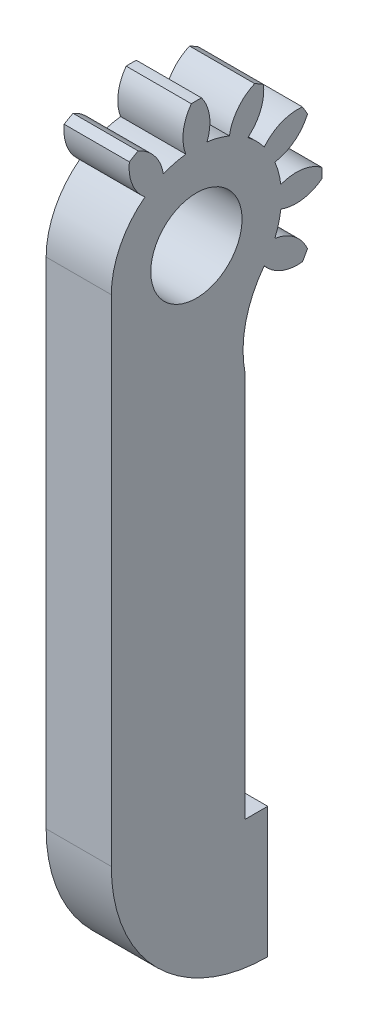
ISO-10303-21;
HEADER;
FILE_DESCRIPTION(('STEP AP214'),'2;1');
FILE_NAME('part.step','',(''),(''),'','','');
FILE_SCHEMA(('AUTOMOTIVE_DESIGN { 1 0 10303 214 1 1 1 1 }'));
ENDSEC;
DATA;
#1=APPLICATION_CONTEXT('core data for automotive mechanical design processes');
#2=APPLICATION_PROTOCOL_DEFINITION('international standard','automotive_design',2000,#1);
#3=PRODUCT_CONTEXT('',#1,'mechanical');
#4=PRODUCT('Part','Part','',(#3));
#5=PRODUCT_RELATED_PRODUCT_CATEGORY('part','',(#4));
#6=PRODUCT_DEFINITION_FORMATION('','',#4);
#7=PRODUCT_DEFINITION_CONTEXT('part definition',#1,'design');
#8=PRODUCT_DEFINITION('design','',#6,#7);
#9=PRODUCT_DEFINITION_SHAPE('','',#8);
#10=(LENGTH_UNIT() NAMED_UNIT(*) SI_UNIT(.MILLI.,.METRE.));
#11=(NAMED_UNIT(*) PLANE_ANGLE_UNIT() SI_UNIT($,.RADIAN.));
#12=(NAMED_UNIT(*) SI_UNIT($,.STERADIAN.) SOLID_ANGLE_UNIT());
#13=UNCERTAINTY_MEASURE_WITH_UNIT(LENGTH_MEASURE(1.E-05),#10,'distance_accuracy_value','');
#14=(GEOMETRIC_REPRESENTATION_CONTEXT(3) GLOBAL_UNCERTAINTY_ASSIGNED_CONTEXT((#13)) GLOBAL_UNIT_ASSIGNED_CONTEXT((#10,
#11,#12)) REPRESENTATION_CONTEXT('',''));
#15=CARTESIAN_POINT('',(0.,0.,0.));
#16=DIRECTION('',(0.,0.,1.));
#17=DIRECTION('',(1.,0.,0.));
#18=AXIS2_PLACEMENT_3D('',#15,#16,#17);
#19=CARTESIAN_POINT('',(-1.01275217110695,-0.00615882570672582,-0.00165025237444129));
#20=DIRECTION('',(-1.,0.,0.));
#21=DIRECTION('',(0.,-0.258819045102521,0.965925826289068));
#22=AXIS2_PLACEMENT_3D('',#19,#20,#21);
#23=CYLINDRICAL_SURFACE('',#22,6.53025);
#24=CARTESIAN_POINT('',(-6.01275217110695,-0.00615882570672582,-0.00165025237444129));
#25=DIRECTION('',(-1.,0.,0.));
#26=DIRECTION('',(0.,0.707106781186549,-0.707106781186546));
#27=AXIS2_PLACEMENT_3D('',#24,#25,#26);
#28=CIRCLE('',#27,6.53025);
#29=CARTESIAN_POINT('',(-6.01275217110694,-0.00615882570677142,6.52859974762556));
#30=VERTEX_POINT('',#29);
#31=CARTESIAN_POINT('',(-6.01275217110695,5.19691520860074,3.9445106232128));
#32=VERTEX_POINT('',#31);
#33=EDGE_CURVE('E250',#30,#32,#28,.T.);
#34=ORIENTED_EDGE('',*,*,#33,.F.);
#35=DIRECTION('',(1.,0.,0.));
#36=VECTOR('',#35,1.);
#37=CARTESIAN_POINT('',(-57.4266039560147,-0.00615882570677142,6.52859974762556));
#38=LINE('',#37,#36);
#39=CARTESIAN_POINT('',(-1.01275217110695,-0.00615882570677142,6.52859974762556));
#40=VERTEX_POINT('',#39);
#41=EDGE_CURVE('E236',#30,#40,#38,.T.);
#42=ORIENTED_EDGE('',*,*,#41,.T.);
#43=CARTESIAN_POINT('',(-1.01275217110695,-0.00615882570672582,-0.00165025237444129));
#44=DIRECTION('',(-1.,0.,0.));
#45=DIRECTION('',(0.,0.707106781186549,-0.707106781186546));
#46=AXIS2_PLACEMENT_3D('',#43,#44,#45);
#47=CIRCLE('',#46,6.53025);
#48=CARTESIAN_POINT('',(-1.01275217110695,5.19691520860074,3.9445106232128));
#49=VERTEX_POINT('',#48);
#50=EDGE_CURVE('E248',#40,#49,#47,.T.);
#51=ORIENTED_EDGE('',*,*,#50,.T.);
#52=DIRECTION('',(-1.,0.,0.));
#53=VECTOR('',#52,1.);
#54=CARTESIAN_POINT('',(-1.01275217110695,5.19691520860074,3.9445106232128));
#55=LINE('',#54,#53);
#56=EDGE_CURVE('E256',#49,#32,#55,.T.);
#57=ORIENTED_EDGE('',*,*,#56,.T.);
#58=EDGE_LOOP('',(#34,#42,#51,#57));
#59=FACE_BOUND('',#58,.T.);
#60=ADVANCED_FACE('F33',(#59),#23,.T.);
#61=CARTESIAN_POINT('',(-1.01275217110695,-0.00615882570672582,-0.00165025237444129));
#62=DIRECTION('',(-1.,0.,0.));
#63=DIRECTION('',(0.,-0.258819045102521,0.965925826289068));
#64=AXIS2_PLACEMENT_3D('',#61,#62,#63);
#65=PLANE('',#64);
#66=CARTESIAN_POINT('',(-1.01275217110695,-0.00615882570672582,-0.00165025237444129));
#67=DIRECTION('',(-1.,0.,0.));
#68=DIRECTION('',(0.,-0.258819045102521,0.965925826289068));
#69=AXIS2_PLACEMENT_3D('',#66,#67,#68);
#70=CIRCLE('',#69,3.5);
#71=CARTESIAN_POINT('',(-1.01275217110695,-0.912025483565551,3.3790901396373));
#72=VERTEX_POINT('',#71);
#73=EDGE_CURVE('E448',#72,#72,#70,.F.);
#74=ORIENTED_EDGE('',*,*,#73,.F.);
#75=EDGE_LOOP('',(#74));
#76=FACE_BOUND('',#75,.T.);
#77=ORIENTED_EDGE('',*,*,#50,.F.);
#78=DIRECTION('',(0.,-1.,0.));
#79=VECTOR('',#78,1.);
#80=CARTESIAN_POINT('',(-1.01275217110695,-0.00615882570677142,6.52859974762556));
#81=LINE('',#80,#79);
#82=CARTESIAN_POINT('',(-1.01275217110695,-38.,6.52859974762556));
#83=VERTEX_POINT('',#82);
#84=EDGE_CURVE('E232',#40,#83,#81,.T.);
#85=ORIENTED_EDGE('',*,*,#84,.T.);
#86=CARTESIAN_POINT('',(-1.01275217110695,-38.,-5.47140025237444));
#87=DIRECTION('',(1.,0.,0.));
#88=DIRECTION('',(0.,0.,-1.));
#89=AXIS2_PLACEMENT_3D('',#86,#87,#88);
#90=CIRCLE('',#89,12.);
#91=CARTESIAN_POINT('',(-1.01275217110695,-50.,-5.47140025237445));
#92=VERTEX_POINT('',#91);
#93=EDGE_CURVE('E244',#83,#92,#90,.T.);
#94=ORIENTED_EDGE('',*,*,#93,.T.);
#95=DIRECTION('',(0.,1.,0.));
#96=VECTOR('',#95,1.);
#97=CARTESIAN_POINT('',(-1.01275217110695,-50.,-5.47140025237445));
#98=LINE('',#97,#96);
#99=CARTESIAN_POINT('',(-1.01275217110695,-40.,-5.47140025237444));
#100=VERTEX_POINT('',#99);
#101=EDGE_CURVE('E721',#92,#100,#98,.T.);
#102=ORIENTED_EDGE('',*,*,#101,.T.);
#103=DIRECTION('',(0.,0.,1.));
#104=VECTOR('',#103,1.);
#105=CARTESIAN_POINT('',(-1.01275217110695,-40.,-5.47140025237444));
#106=LINE('',#105,#104);
#107=CARTESIAN_POINT('',(-1.01275217110695,-40.,-3.72140025237444));
#108=VERTEX_POINT('',#107);
#109=EDGE_CURVE('E733',#100,#108,#106,.T.);
#110=ORIENTED_EDGE('',*,*,#109,.T.);
#111=DIRECTION('',(0.,1.,0.));
#112=VECTOR('',#111,1.);
#113=CARTESIAN_POINT('',(-1.01275217110695,-40.,-3.72140025237444));
#114=LINE('',#113,#112);
#115=CARTESIAN_POINT('',(-1.01275217110695,-10.2901590982053,-3.72140025237444));
#116=VERTEX_POINT('',#115);
#117=EDGE_CURVE('E730',#108,#116,#114,.T.);
#118=ORIENTED_EDGE('',*,*,#117,.T.);
#119=CARTESIAN_POINT('',(-1.01275217110695,-8.7866349273109,-11.5788435431362));
#120=DIRECTION('',(-1.,0.,0.));
#121=DIRECTION('',(0.,0.,-1.));
#122=AXIS2_PLACEMENT_3D('',#119,#120,#121);
#123=CIRCLE('',#122,8.);
#124=CARTESIAN_POINT('',(-1.01275217110695,-3.95231970129391,-5.20472428668195));
#125=VERTEX_POINT('',#124);
#126=EDGE_CURVE('E251',#116,#125,#123,.T.);
#127=ORIENTED_EDGE('',*,*,#126,.T.);
#128=CARTESIAN_POINT('',(-1.01275217110695,-1.87338844029855,-7.76754398616458));
#129=DIRECTION('',(-1.,0.,0.));
#130=DIRECTION('',(0.,-0.707106781186554,0.707106781186541));
#131=AXIS2_PLACEMENT_3D('',#128,#129,#130);
#132=CIRCLE('',#131,3.3);
#133=CARTESIAN_POINT('',(-1.01275217110695,-5.1528616593277,-8.13504283741532));
#134=VERTEX_POINT('',#133);
#135=EDGE_CURVE('E373',#134,#125,#132,.T.);
#136=ORIENTED_EDGE('',*,*,#135,.F.);
#137=CARTESIAN_POINT('',(-1.01275217110695,-0.00615882570672582,-0.00165025237444129));
#138=DIRECTION('',(-1.,0.,0.));
#139=DIRECTION('',(0.,-0.258819045102521,0.965925826289068));
#140=AXIS2_PLACEMENT_3D('',#137,#138,#139);
#141=CIRCLE('',#140,9.625);
#142=CARTESIAN_POINT('',(-1.01275217110695,-4.47653200649346,-8.52552194454008));
#143=VERTEX_POINT('',#142);
#144=EDGE_CURVE('E303',#143,#134,#141,.T.);
#145=ORIENTED_EDGE('',*,*,#144,.F.);
#146=CARTESIAN_POINT('',(-1.01275217110695,-5.79800527496336,-5.50166540020477));
#147=DIRECTION('',(-1.,0.,0.));
#148=DIRECTION('',(0.,-0.965925826289071,0.258819045102511));
#149=AXIS2_PLACEMENT_3D('',#146,#147,#148);
#150=CIRCLE('',#149,3.3);
#151=CARTESIAN_POINT('',(-1.01275217110695,-2.53907267939451,-6.02066283520699));
#152=VERTEX_POINT('',#151);
#153=EDGE_CURVE('E370',#152,#143,#150,.T.);
#154=ORIENTED_EDGE('',*,*,#153,.F.);
#155=CARTESIAN_POINT('',(-1.01275217110695,-0.00615882570672582,-0.00165025237444129));
#156=DIRECTION('',(-1.,0.,0.));
#157=DIRECTION('',(0.,-0.965925826289071,0.258819045102511));
#158=AXIS2_PLACEMENT_3D('',#155,#156,#157);
#159=CIRCLE('',#158,6.53025);
#160=CARTESIAN_POINT('',(-1.01275217110695,-0.82209737423171,-6.48072498164952));
#161=VERTEX_POINT('',#160);
#162=EDGE_CURVE('E460',#161,#152,#159,.T.);
#163=ORIENTED_EDGE('',*,*,#162,.F.);
#164=CARTESIAN_POINT('',(-1.01275217110695,2.25971976025321,-7.660726316223));
#165=DIRECTION('',(-1.,0.,0.));
#166=DIRECTION('',(0.,-0.965925826289071,0.258819045102511));
#167=AXIS2_PLACEMENT_3D('',#164,#165,#166);
#168=CIRCLE('',#167,3.3);
#169=CARTESIAN_POINT('',(-1.01275217110695,-0.396637932831394,-9.61872626678231));
#170=VERTEX_POINT('',#169);
#171=EDGE_CURVE('E457',#170,#161,#168,.T.);
#172=ORIENTED_EDGE('',*,*,#171,.F.);
#173=CARTESIAN_POINT('',(-1.01275217110695,0.384320281418145,-9.6187262667823));
#174=VERTEX_POINT('',#173);
#175=EDGE_CURVE('E374',#174,#170,#141,.T.);
#176=ORIENTED_EDGE('',*,*,#175,.F.);
#177=CARTESIAN_POINT('',(-1.01275217110695,-2.2720374116665,-7.66072631622305));
#178=DIRECTION('',(-1.,0.,0.));
#179=DIRECTION('',(0.,-0.965925826289065,-0.258819045102531));
#180=AXIS2_PLACEMENT_3D('',#177,#178,#179);
#181=CIRCLE('',#180,3.3);
#182=CARTESIAN_POINT('',(-1.01275217110695,0.809779722818396,-6.48072498164951));
#183=VERTEX_POINT('',#182);
#184=EDGE_CURVE('E471',#183,#174,#181,.T.);
#185=ORIENTED_EDGE('',*,*,#184,.F.);
#186=CARTESIAN_POINT('',(-1.01275217110695,-0.00615882570672582,-0.00165025237444129));
#187=DIRECTION('',(-1.,0.,0.));
#188=DIRECTION('',(0.,-0.965925826289065,-0.258819045102531));
#189=AXIS2_PLACEMENT_3D('',#186,#187,#188);
#190=CIRCLE('',#189,6.53025);
#191=CARTESIAN_POINT('',(-1.01275217110695,2.52675502798118,-6.02066283520694));
#192=VERTEX_POINT('',#191);
#193=EDGE_CURVE('E476',#192,#183,#190,.T.);
#194=ORIENTED_EDGE('',*,*,#193,.F.);
#195=CARTESIAN_POINT('',(-1.01275217110695,5.78568762355002,-5.50166540020464));
#196=DIRECTION('',(-1.,0.,0.));
#197=DIRECTION('',(0.,-0.965925826289065,-0.258819045102531));
#198=AXIS2_PLACEMENT_3D('',#195,#196,#197);
#199=CIRCLE('',#198,3.3);
#200=CARTESIAN_POINT('',(-1.01275217110695,4.46421435508019,-8.52552194453999));
#201=VERTEX_POINT('',#200);
#202=EDGE_CURVE('E473',#201,#192,#199,.T.);
#203=ORIENTED_EDGE('',*,*,#202,.F.);
#204=CARTESIAN_POINT('',(-1.01275217110695,5.14054400791442,-8.13504283741521));
#205=VERTEX_POINT('',#204);
#206=EDGE_CURVE('E358',#205,#201,#141,.T.);
#207=ORIENTED_EDGE('',*,*,#206,.F.);
#208=CARTESIAN_POINT('',(-1.01275217110695,1.86107078888526,-7.76754398616454));
#209=DIRECTION('',(-1.,0.,0.));
#210=DIRECTION('',(0.,-0.707106781186539,-0.707106781186556));
#211=AXIS2_PLACEMENT_3D('',#208,#209,#210);
#212=CIRCLE('',#211,3.3);
#213=CARTESIAN_POINT('',(-1.01275217110695,3.94000204988057,-5.20472428668187));
#214=VERTEX_POINT('',#213);
#215=EDGE_CURVE('E396',#214,#205,#212,.T.);
#216=ORIENTED_EDGE('',*,*,#215,.F.);
#217=CARTESIAN_POINT('',(-1.01275217110695,-0.00615882570672582,-0.00165025237444129));
#218=DIRECTION('',(-1.,0.,0.));
#219=DIRECTION('',(0.,-0.707106781186539,-0.707106781186556));
#220=AXIS2_PLACEMENT_3D('',#217,#218,#219);
#221=CIRCLE('',#220,6.53025);
#222=CARTESIAN_POINT('',(-1.01275217110695,5.1969152086008,-3.94781112796161));
#223=VERTEX_POINT('',#222);
#224=EDGE_CURVE('E393',#223,#214,#221,.T.);
#225=ORIENTED_EDGE('',*,*,#224,.F.);
#226=CARTESIAN_POINT('',(-1.01275217110695,7.75973490808342,-1.86887986696624));
#227=DIRECTION('',(-1.,0.,0.));
#228=DIRECTION('',(0.,-0.707106781186539,-0.707106781186556));
#229=AXIS2_PLACEMENT_3D('',#226,#227,#228);
#230=CIRCLE('',#229,3.3);
#231=CARTESIAN_POINT('',(-1.01275217110695,8.12723375933417,-5.14835308599538));
#232=VERTEX_POINT('',#231);
#233=EDGE_CURVE('E391',#232,#223,#230,.T.);
#234=ORIENTED_EDGE('',*,*,#233,.F.);
#235=CARTESIAN_POINT('',(-1.01275217110695,8.51771286645893,-4.47202343316115));
#236=VERTEX_POINT('',#235);
#237=EDGE_CURVE('E302',#236,#232,#141,.T.);
#238=ORIENTED_EDGE('',*,*,#237,.F.);
#239=CARTESIAN_POINT('',(-1.01275217110695,5.49385632212362,-5.79349670163106));
#240=DIRECTION('',(-1.,0.,0.));
#241=DIRECTION('',(0.,-0.258819045102508,-0.965925826289072));
#242=AXIS2_PLACEMENT_3D('',#239,#240,#241);
#243=CIRCLE('',#242,3.3);
#244=CARTESIAN_POINT('',(-1.01275217110695,6.01285375712583,-2.5345641060622));
#245=VERTEX_POINT('',#244);
#246=EDGE_CURVE('E389',#245,#236,#243,.T.);
#247=ORIENTED_EDGE('',*,*,#246,.F.);
#248=CARTESIAN_POINT('',(-1.01275217110695,-0.00615882570672582,-0.00165025237444129));
#249=DIRECTION('',(-1.,0.,0.));
#250=DIRECTION('',(0.,-0.258819045102508,-0.965925826289072));
#251=AXIS2_PLACEMENT_3D('',#248,#249,#250);
#252=CIRCLE('',#251,6.53025);
#253=CARTESIAN_POINT('',(-1.01275217110695,6.47291590356836,-0.817588800899403));
#254=VERTEX_POINT('',#253);
#255=EDGE_CURVE('E423',#254,#245,#252,.T.);
#256=ORIENTED_EDGE('',*,*,#255,.F.);
#257=CARTESIAN_POINT('',(-1.01275217110695,7.65291723814182,2.26422833358552));
#258=DIRECTION('',(-1.,0.,0.));
#259=DIRECTION('',(0.,-0.258819045102508,-0.965925826289072));
#260=AXIS2_PLACEMENT_3D('',#257,#258,#259);
#261=CIRCLE('',#260,3.3);
#262=CARTESIAN_POINT('',(-1.01275217110695,9.61091718870115,-0.392129359499075));
#263=VERTEX_POINT('',#262);
#264=EDGE_CURVE('E416',#263,#254,#261,.T.);
#265=ORIENTED_EDGE('',*,*,#264,.F.);
#266=CARTESIAN_POINT('',(-1.01275217110695,9.61091718870114,0.388828854750329));
#267=VERTEX_POINT('',#266);
#268=EDGE_CURVE('E298',#267,#263,#141,.T.);
#269=ORIENTED_EDGE('',*,*,#268,.F.);
#270=CARTESIAN_POINT('',(-1.01275217110695,7.65291723814186,-2.26752883833429));
#271=DIRECTION('',(-1.,0.,0.));
#272=DIRECTION('',(0.,0.258819045102521,-0.965925826289068));
#273=AXIS2_PLACEMENT_3D('',#270,#271,#272);
#274=CIRCLE('',#273,3.3);
#275=CARTESIAN_POINT('',(-1.01275217110695,6.47291590356835,0.814288296150612));
#276=VERTEX_POINT('',#275);
#277=EDGE_CURVE('E270',#276,#267,#274,.T.);
#278=ORIENTED_EDGE('',*,*,#277,.F.);
#279=CARTESIAN_POINT('',(-1.01275217110695,-0.00615882570672582,-0.00165025237444129));
#280=DIRECTION('',(-1.,0.,0.));
#281=DIRECTION('',(0.,0.258819045102521,-0.965925826289068));
#282=AXIS2_PLACEMENT_3D('',#279,#280,#281);
#283=CIRCLE('',#282,6.53025);
#284=CARTESIAN_POINT('',(-1.01275217110695,6.0128537571258,2.5312636013134));
#285=VERTEX_POINT('',#284);
#286=EDGE_CURVE('E275',#285,#276,#283,.T.);
#287=ORIENTED_EDGE('',*,*,#286,.F.);
#288=CARTESIAN_POINT('',(-1.01275217110695,5.49385632212354,5.79019619688225));
#289=DIRECTION('',(-1.,0.,0.));
#290=DIRECTION('',(0.,0.258819045102521,-0.965925826289068));
#291=AXIS2_PLACEMENT_3D('',#288,#289,#290);
#292=CIRCLE('',#291,3.3);
#293=CARTESIAN_POINT('',(-1.01275217110695,8.51771286645887,4.46872292841239));
#294=VERTEX_POINT('',#293);
#295=EDGE_CURVE('E272',#294,#285,#292,.T.);
#296=ORIENTED_EDGE('',*,*,#295,.F.);
#297=CARTESIAN_POINT('',(-1.01275217110695,8.12723375933409,5.14505258124662));
#298=VERTEX_POINT('',#297);
#299=EDGE_CURVE('E295',#298,#294,#141,.T.);
#300=ORIENTED_EDGE('',*,*,#299,.F.);
#301=CARTESIAN_POINT('',(-1.01275217110695,7.75973490808339,1.86557936221747));
#302=DIRECTION('',(-1.,0.,0.));
#303=DIRECTION('',(0.,0.707106781186549,-0.707106781186546));
#304=AXIS2_PLACEMENT_3D('',#301,#302,#303);
#305=CIRCLE('',#304,3.3);
#306=EDGE_CURVE('E255',#49,#298,#305,.T.);
#307=ORIENTED_EDGE('',*,*,#306,.F.);
#308=EDGE_LOOP('',(#77,#85,#94,#102,#110,#118,#127,#136,#145,#154,#163,#172,#176,#185,#194,#203,
#207,#216,#225,#234,#238,#247,#256,#265,#269,#278,#287,#296,#300,#307));
#309=FACE_BOUND('',#308,.T.);
#310=ADVANCED_FACE('F35',(#76,#309),#65,.F.);
#311=CARTESIAN_POINT('',(-16.0127521711069,-0.00615882570672582,-0.00165025237444129));
#312=DIRECTION('',(-1.,0.,0.));
#313=DIRECTION('',(0.,-0.258819045102521,0.965925826289068));
#314=AXIS2_PLACEMENT_3D('',#311,#312,#313);
#315=CYLINDRICAL_SURFACE('',#314,9.625);
#316=DIRECTION('',(-1.,0.,0.));
#317=VECTOR('',#316,1.);
#318=CARTESIAN_POINT('',(-3.51275217110695,-4.47653200649346,-8.52552194454008));
#319=LINE('',#318,#317);
#320=CARTESIAN_POINT('',(-6.01275217110695,-4.47653200649346,-8.52552194454008));
#321=VERTEX_POINT('',#320);
#322=EDGE_CURVE('E266',#143,#321,#319,.T.);
#323=ORIENTED_EDGE('',*,*,#322,.F.);
#324=ORIENTED_EDGE('',*,*,#144,.T.);
#325=DIRECTION('',(-1.,0.,0.));
#326=VECTOR('',#325,1.);
#327=CARTESIAN_POINT('',(-3.51275217110695,-5.1528616593277,-8.13504283741532));
#328=LINE('',#327,#326);
#329=CARTESIAN_POINT('',(-6.01275217110695,-5.1528616593277,-8.13504283741532));
#330=VERTEX_POINT('',#329);
#331=EDGE_CURVE('E318',#330,#134,#328,.F.);
#332=ORIENTED_EDGE('',*,*,#331,.F.);
#333=CARTESIAN_POINT('',(-6.01275217110695,-0.00615882570672582,-0.00165025237444129));
#334=DIRECTION('',(-1.,0.,0.));
#335=DIRECTION('',(0.,-0.258819045102521,0.965925826289068));
#336=AXIS2_PLACEMENT_3D('',#333,#334,#335);
#337=CIRCLE('',#336,9.625);
#338=EDGE_CURVE('E297',#321,#330,#337,.T.);
#339=ORIENTED_EDGE('',*,*,#338,.F.);
#340=EDGE_LOOP('',(#323,#324,#332,#339));
#341=FACE_BOUND('',#340,.T.);
#342=ADVANCED_FACE('F327',(#341),#315,.T.);
#343=DIRECTION('',(-1.,0.,0.));
#344=VECTOR('',#343,1.);
#345=CARTESIAN_POINT('',(-3.51275217110695,-0.396637932831395,-9.61872626678231));
#346=LINE('',#345,#344);
#347=CARTESIAN_POINT('',(-6.01275217110695,-0.396637932831395,-9.61872626678231));
#348=VERTEX_POINT('',#347);
#349=EDGE_CURVE('E329',#348,#170,#346,.F.);
#350=ORIENTED_EDGE('',*,*,#349,.F.);
#351=CARTESIAN_POINT('',(-6.01275217110695,0.384320281418145,-9.6187262667823));
#352=VERTEX_POINT('',#351);
#353=EDGE_CURVE('E334',#352,#348,#337,.T.);
#354=ORIENTED_EDGE('',*,*,#353,.F.);
#355=DIRECTION('',(-1.,0.,0.));
#356=VECTOR('',#355,1.);
#357=CARTESIAN_POINT('',(-3.51275217110695,0.384320281418145,-9.6187262667823));
#358=LINE('',#357,#356);
#359=EDGE_CURVE('E330',#174,#352,#358,.T.);
#360=ORIENTED_EDGE('',*,*,#359,.F.);
#361=ORIENTED_EDGE('',*,*,#175,.T.);
#362=EDGE_LOOP('',(#350,#354,#360,#361));
#363=FACE_BOUND('',#362,.T.);
#364=ADVANCED_FACE('F532',(#363),#315,.T.);
#365=DIRECTION('',(-1.,0.,0.));
#366=VECTOR('',#365,1.);
#367=CARTESIAN_POINT('',(-3.51275217110695,4.46421435508019,-8.52552194453999));
#368=LINE('',#367,#366);
#369=CARTESIAN_POINT('',(-6.01275217110695,4.46421435508019,-8.52552194453999));
#370=VERTEX_POINT('',#369);
#371=EDGE_CURVE('E357',#370,#201,#368,.F.);
#372=ORIENTED_EDGE('',*,*,#371,.F.);
#373=CARTESIAN_POINT('',(-6.01275217110695,5.14054400791442,-8.13504283741521));
#374=VERTEX_POINT('',#373);
#375=EDGE_CURVE('E336',#374,#370,#337,.T.);
#376=ORIENTED_EDGE('',*,*,#375,.F.);
#377=DIRECTION('',(-1.,0.,0.));
#378=VECTOR('',#377,1.);
#379=CARTESIAN_POINT('',(-3.51275217110695,5.14054400791442,-8.13504283741521));
#380=LINE('',#379,#378);
#381=EDGE_CURVE('E355',#205,#374,#380,.T.);
#382=ORIENTED_EDGE('',*,*,#381,.F.);
#383=ORIENTED_EDGE('',*,*,#206,.T.);
#384=EDGE_LOOP('',(#372,#376,#382,#383));
#385=FACE_BOUND('',#384,.T.);
#386=ADVANCED_FACE('F353',(#385),#315,.T.);
#387=DIRECTION('',(-1.,0.,0.));
#388=VECTOR('',#387,1.);
#389=CARTESIAN_POINT('',(-3.51275217110695,8.51771286645893,-4.47202343316115));
#390=LINE('',#389,#388);
#391=CARTESIAN_POINT('',(-6.01275217110695,8.51771286645893,-4.47202343316115));
#392=VERTEX_POINT('',#391);
#393=EDGE_CURVE('E361',#236,#392,#390,.T.);
#394=ORIENTED_EDGE('',*,*,#393,.F.);
#395=ORIENTED_EDGE('',*,*,#237,.T.);
#396=DIRECTION('',(-1.,0.,0.));
#397=VECTOR('',#396,1.);
#398=CARTESIAN_POINT('',(-3.51275217110695,8.12723375933417,-5.14835308599538));
#399=LINE('',#398,#397);
#400=CARTESIAN_POINT('',(-6.01275217110695,8.12723375933417,-5.14835308599538));
#401=VERTEX_POINT('',#400);
#402=EDGE_CURVE('E385',#401,#232,#399,.F.);
#403=ORIENTED_EDGE('',*,*,#402,.F.);
#404=EDGE_CURVE('E296',#392,#401,#337,.T.);
#405=ORIENTED_EDGE('',*,*,#404,.F.);
#406=EDGE_LOOP('',(#394,#395,#403,#405));
#407=FACE_BOUND('',#406,.T.);
#408=ADVANCED_FACE('F384',(#407),#315,.T.);
#409=DIRECTION('',(-1.,0.,0.));
#410=VECTOR('',#409,1.);
#411=CARTESIAN_POINT('',(-3.51275217110695,9.61091718870114,-0.392129359499076));
#412=LINE('',#411,#410);
#413=CARTESIAN_POINT('',(-6.01275217110695,9.61091718870114,-0.392129359499076));
#414=VERTEX_POINT('',#413);
#415=EDGE_CURVE('E364',#414,#263,#412,.F.);
#416=ORIENTED_EDGE('',*,*,#415,.F.);
#417=CARTESIAN_POINT('',(-6.01275217110695,9.61091718870114,0.388828854750329));
#418=VERTEX_POINT('',#417);
#419=EDGE_CURVE('E292',#418,#414,#337,.T.);
#420=ORIENTED_EDGE('',*,*,#419,.F.);
#421=DIRECTION('',(-1.,0.,0.));
#422=VECTOR('',#421,1.);
#423=CARTESIAN_POINT('',(-3.51275217110695,9.61091718870114,0.388828854750329));
#424=LINE('',#423,#422);
#425=EDGE_CURVE('E289',#267,#418,#424,.T.);
#426=ORIENTED_EDGE('',*,*,#425,.F.);
#427=ORIENTED_EDGE('',*,*,#268,.T.);
#428=EDGE_LOOP('',(#416,#420,#426,#427));
#429=FACE_BOUND('',#428,.T.);
#430=ADVANCED_FACE('F426',(#429),#315,.T.);
#431=CARTESIAN_POINT('',(-6.01275217110695,-0.00615882570672582,-0.00165025237444129));
#432=DIRECTION('',(1.,0.,0.));
#433=DIRECTION('',(0.,0.258819045102521,-0.965925826289068));
#434=AXIS2_PLACEMENT_3D('',#431,#432,#433);
#435=PLANE('',#434);
#436=CARTESIAN_POINT('',(-6.01275217110695,-0.00615882570672582,-0.00165025237444129));
#437=DIRECTION('',(1.,0.,0.));
#438=DIRECTION('',(0.,0.258819045102521,-0.965925826289068));
#439=AXIS2_PLACEMENT_3D('',#436,#437,#438);
#440=CIRCLE('',#439,3.5);
#441=CARTESIAN_POINT('',(-6.01275217110695,0.899707832152099,-3.38239064438618));
#442=VERTEX_POINT('',#441);
#443=EDGE_CURVE('E37',#442,#442,#440,.F.);
#444=ORIENTED_EDGE('',*,*,#443,.F.);
#445=EDGE_LOOP('',(#444));
#446=FACE_BOUND('',#445,.T.);
#447=CARTESIAN_POINT('',(-6.01275217110695,-1.87338844029855,-7.76754398616458));
#448=DIRECTION('',(1.,0.,0.));
#449=DIRECTION('',(0.,0.258819045102521,-0.965925826289068));
#450=AXIS2_PLACEMENT_3D('',#447,#448,#449);
#451=CIRCLE('',#450,3.3);
#452=CARTESIAN_POINT('',(-6.01275217110695,-3.95231970129391,-5.20472428668195));
#453=VERTEX_POINT('',#452);
#454=EDGE_CURVE('E42',#453,#330,#451,.T.);
#455=ORIENTED_EDGE('',*,*,#454,.F.);
#456=CARTESIAN_POINT('',(-6.01275217110694,-8.7866349273109,-11.5788435431362));
#457=DIRECTION('',(1.,0.,0.));
#458=DIRECTION('',(0.,0.,-1.));
#459=AXIS2_PLACEMENT_3D('',#456,#457,#458);
#460=CIRCLE('',#459,8.);
#461=CARTESIAN_POINT('',(-6.01275217110694,-10.2901590982053,-3.72140025237444));
#462=VERTEX_POINT('',#461);
#463=EDGE_CURVE('E445',#453,#462,#460,.T.);
#464=ORIENTED_EDGE('',*,*,#463,.T.);
#465=DIRECTION('',(0.,-1.,0.));
#466=VECTOR('',#465,1.);
#467=CARTESIAN_POINT('',(-6.01275217110694,-40.,-3.72140025237444));
#468=LINE('',#467,#466);
#469=CARTESIAN_POINT('',(-6.01275217110694,-40.,-3.72140025237444));
#470=VERTEX_POINT('',#469);
#471=EDGE_CURVE('E449',#462,#470,#468,.T.);
#472=ORIENTED_EDGE('',*,*,#471,.T.);
#473=DIRECTION('',(0.,0.,-1.));
#474=VECTOR('',#473,1.);
#475=CARTESIAN_POINT('',(-6.01275217110694,-40.,-5.47140025237444));
#476=LINE('',#475,#474);
#477=CARTESIAN_POINT('',(-6.01275217110694,-40.,-5.47140025237444));
#478=VERTEX_POINT('',#477);
#479=EDGE_CURVE('E739',#470,#478,#476,.T.);
#480=ORIENTED_EDGE('',*,*,#479,.T.);
#481=DIRECTION('',(0.,-1.,0.));
#482=VECTOR('',#481,1.);
#483=CARTESIAN_POINT('',(-6.01275217110694,-50.,-5.47140025237445));
#484=LINE('',#483,#482);
#485=CARTESIAN_POINT('',(-6.01275217110694,-50.,-5.47140025237445));
#486=VERTEX_POINT('',#485);
#487=EDGE_CURVE('E715',#478,#486,#484,.T.);
#488=ORIENTED_EDGE('',*,*,#487,.T.);
#489=CARTESIAN_POINT('',(-6.01275217110694,-38.,-5.47140025237444));
#490=DIRECTION('',(1.,0.,0.));
#491=DIRECTION('',(0.,0.,-1.));
#492=AXIS2_PLACEMENT_3D('',#489,#490,#491);
#493=CIRCLE('',#492,12.);
#494=CARTESIAN_POINT('',(-6.01275217110694,-38.,6.52859974762556));
#495=VERTEX_POINT('',#494);
#496=EDGE_CURVE('E444',#486,#495,#493,.F.);
#497=ORIENTED_EDGE('',*,*,#496,.T.);
#498=DIRECTION('',(0.,1.,0.));
#499=VECTOR('',#498,1.);
#500=CARTESIAN_POINT('',(-6.01275217110694,-0.00615882570677142,6.52859974762556));
#501=LINE('',#500,#499);
#502=EDGE_CURVE('E442',#495,#30,#501,.T.);
#503=ORIENTED_EDGE('',*,*,#502,.T.);
#504=ORIENTED_EDGE('',*,*,#33,.T.);
#505=CARTESIAN_POINT('',(-6.01275217110695,7.75973490808339,1.86557936221747));
#506=DIRECTION('',(-1.,0.,0.));
#507=DIRECTION('',(0.,0.707106781186549,-0.707106781186546));
#508=AXIS2_PLACEMENT_3D('',#505,#506,#507);
#509=CIRCLE('',#508,3.3);
#510=CARTESIAN_POINT('',(-6.01275217110695,8.12723375933409,5.14505258124662));
#511=VERTEX_POINT('',#510);
#512=EDGE_CURVE('E263',#32,#511,#509,.T.);
#513=ORIENTED_EDGE('',*,*,#512,.T.);
#514=CARTESIAN_POINT('',(-6.01275217110695,8.51771286645886,4.46872292841238));
#515=VERTEX_POINT('',#514);
#516=EDGE_CURVE('E291',#511,#515,#337,.T.);
#517=ORIENTED_EDGE('',*,*,#516,.T.);
#518=CARTESIAN_POINT('',(-6.01275217110695,5.49385632212354,5.79019619688225));
#519=DIRECTION('',(1.,0.,0.));
#520=DIRECTION('',(0.,0.258819045102521,-0.965925826289068));
#521=AXIS2_PLACEMENT_3D('',#518,#519,#520);
#522=CIRCLE('',#521,3.3);
#523=CARTESIAN_POINT('',(-6.01275217110695,6.0128537571258,2.5312636013134));
#524=VERTEX_POINT('',#523);
#525=EDGE_CURVE('E301',#524,#515,#522,.T.);
#526=ORIENTED_EDGE('',*,*,#525,.F.);
#527=CARTESIAN_POINT('',(-6.01275217110695,-0.00615882570672582,-0.00165025237444129));
#528=DIRECTION('',(-1.,0.,0.));
#529=DIRECTION('',(0.,0.258819045102521,-0.965925826289068));
#530=AXIS2_PLACEMENT_3D('',#527,#528,#529);
#531=CIRCLE('',#530,6.53025);
#532=CARTESIAN_POINT('',(-6.01275217110695,6.47291590356835,0.814288296150612));
#533=VERTEX_POINT('',#532);
#534=EDGE_CURVE('E273',#524,#533,#531,.T.);
#535=ORIENTED_EDGE('',*,*,#534,.T.);
#536=CARTESIAN_POINT('',(-6.01275217110695,7.65291723814186,-2.26752883833429));
#537=DIRECTION('',(-1.,0.,0.));
#538=DIRECTION('',(0.,0.258819045102521,-0.965925826289068));
#539=AXIS2_PLACEMENT_3D('',#536,#537,#538);
#540=CIRCLE('',#539,3.3);
#541=EDGE_CURVE('E269',#533,#418,#540,.T.);
#542=ORIENTED_EDGE('',*,*,#541,.T.);
#543=ORIENTED_EDGE('',*,*,#419,.T.);
#544=CARTESIAN_POINT('',(-6.01275217110695,7.65291723814182,2.26422833358552));
#545=DIRECTION('',(1.,0.,0.));
#546=DIRECTION('',(0.,0.258819045102521,-0.965925826289068));
#547=AXIS2_PLACEMENT_3D('',#544,#545,#546);
#548=CIRCLE('',#547,3.3);
#549=CARTESIAN_POINT('',(-6.01275217110695,6.47291590356836,-0.817588800899403));
#550=VERTEX_POINT('',#549);
#551=EDGE_CURVE('E308',#550,#414,#548,.T.);
#552=ORIENTED_EDGE('',*,*,#551,.F.);
#553=CARTESIAN_POINT('',(-6.01275217110695,-0.00615882570672582,-0.00165025237444129));
#554=DIRECTION('',(-1.,0.,0.));
#555=DIRECTION('',(0.,-0.258819045102508,-0.965925826289072));
#556=AXIS2_PLACEMENT_3D('',#553,#554,#555);
#557=CIRCLE('',#556,6.53025);
#558=CARTESIAN_POINT('',(-6.01275217110695,6.01285375712583,-2.5345641060622));
#559=VERTEX_POINT('',#558);
#560=EDGE_CURVE('E483',#550,#559,#557,.T.);
#561=ORIENTED_EDGE('',*,*,#560,.T.);
#562=CARTESIAN_POINT('',(-6.01275217110695,5.49385632212362,-5.79349670163106));
#563=DIRECTION('',(-1.,0.,0.));
#564=DIRECTION('',(0.,-0.258819045102508,-0.965925826289072));
#565=AXIS2_PLACEMENT_3D('',#562,#563,#564);
#566=CIRCLE('',#565,3.3);
#567=EDGE_CURVE('E455',#559,#392,#566,.T.);
#568=ORIENTED_EDGE('',*,*,#567,.T.);
#569=ORIENTED_EDGE('',*,*,#404,.T.);
#570=CARTESIAN_POINT('',(-6.01275217110695,7.75973490808342,-1.86887986696624));
#571=DIRECTION('',(1.,0.,0.));
#572=DIRECTION('',(0.,0.258819045102521,-0.965925826289068));
#573=AXIS2_PLACEMENT_3D('',#570,#571,#572);
#574=CIRCLE('',#573,3.3);
#575=CARTESIAN_POINT('',(-6.01275217110695,5.1969152086008,-3.94781112796161));
#576=VERTEX_POINT('',#575);
#577=EDGE_CURVE('E306',#576,#401,#574,.T.);
#578=ORIENTED_EDGE('',*,*,#577,.F.);
#579=CARTESIAN_POINT('',(-6.01275217110695,-0.00615882570672582,-0.00165025237444129));
#580=DIRECTION('',(-1.,0.,0.));
#581=DIRECTION('',(0.,-0.707106781186539,-0.707106781186556));
#582=AXIS2_PLACEMENT_3D('',#579,#580,#581);
#583=CIRCLE('',#582,6.53025);
#584=CARTESIAN_POINT('',(-6.01275217110695,3.94000204988057,-5.20472428668187));
#585=VERTEX_POINT('',#584);
#586=EDGE_CURVE('E400',#576,#585,#583,.T.);
#587=ORIENTED_EDGE('',*,*,#586,.T.);
#588=CARTESIAN_POINT('',(-6.01275217110695,1.86107078888526,-7.76754398616454));
#589=DIRECTION('',(-1.,0.,0.));
#590=DIRECTION('',(0.,-0.707106781186539,-0.707106781186556));
#591=AXIS2_PLACEMENT_3D('',#588,#589,#590);
#592=CIRCLE('',#591,3.3);
#593=EDGE_CURVE('E349',#585,#374,#592,.T.);
#594=ORIENTED_EDGE('',*,*,#593,.T.);
#595=ORIENTED_EDGE('',*,*,#375,.T.);
#596=CARTESIAN_POINT('',(-6.01275217110695,5.78568762355002,-5.50166540020464));
#597=DIRECTION('',(1.,0.,0.));
#598=DIRECTION('',(0.,0.258819045102521,-0.965925826289068));
#599=AXIS2_PLACEMENT_3D('',#596,#597,#598);
#600=CIRCLE('',#599,3.3);
#601=CARTESIAN_POINT('',(-6.01275217110695,2.52675502798118,-6.02066283520694));
#602=VERTEX_POINT('',#601);
#603=EDGE_CURVE('E310',#602,#370,#600,.T.);
#604=ORIENTED_EDGE('',*,*,#603,.F.);
#605=CARTESIAN_POINT('',(-6.01275217110695,-0.00615882570672582,-0.00165025237444129));
#606=DIRECTION('',(-1.,0.,0.));
#607=DIRECTION('',(0.,-0.965925826289065,-0.258819045102531));
#608=AXIS2_PLACEMENT_3D('',#605,#606,#607);
#609=CIRCLE('',#608,6.53025);
#610=CARTESIAN_POINT('',(-6.01275217110695,0.809779722818396,-6.48072498164951));
#611=VERTEX_POINT('',#610);
#612=EDGE_CURVE('E474',#602,#611,#609,.T.);
#613=ORIENTED_EDGE('',*,*,#612,.T.);
#614=CARTESIAN_POINT('',(-6.01275217110695,-2.2720374116665,-7.66072631622305));
#615=DIRECTION('',(-1.,0.,0.));
#616=DIRECTION('',(0.,-0.965925826289065,-0.258819045102531));
#617=AXIS2_PLACEMENT_3D('',#614,#615,#616);
#618=CIRCLE('',#617,3.3);
#619=EDGE_CURVE('E57',#611,#352,#618,.T.);
#620=ORIENTED_EDGE('',*,*,#619,.T.);
#621=ORIENTED_EDGE('',*,*,#353,.T.);
#622=CARTESIAN_POINT('',(-6.01275217110695,2.25971976025321,-7.660726316223));
#623=DIRECTION('',(1.,0.,0.));
#624=DIRECTION('',(0.,0.258819045102521,-0.965925826289068));
#625=AXIS2_PLACEMENT_3D('',#622,#623,#624);
#626=CIRCLE('',#625,3.3);
#627=CARTESIAN_POINT('',(-6.01275217110695,-0.82209737423171,-6.48072498164952));
#628=VERTEX_POINT('',#627);
#629=EDGE_CURVE('E11',#628,#348,#626,.T.);
#630=ORIENTED_EDGE('',*,*,#629,.F.);
#631=CARTESIAN_POINT('',(-6.01275217110695,-0.00615882570672582,-0.00165025237444129));
#632=DIRECTION('',(-1.,0.,0.));
#633=DIRECTION('',(0.,-0.965925826289071,0.258819045102511));
#634=AXIS2_PLACEMENT_3D('',#631,#632,#633);
#635=CIRCLE('',#634,6.53025);
#636=CARTESIAN_POINT('',(-6.01275217110695,-2.53907267939451,-6.02066283520699));
#637=VERTEX_POINT('',#636);
#638=EDGE_CURVE('E458',#628,#637,#635,.T.);
#639=ORIENTED_EDGE('',*,*,#638,.T.);
#640=CARTESIAN_POINT('',(-6.01275217110695,-5.79800527496336,-5.50166540020477));
#641=DIRECTION('',(-1.,0.,0.));
#642=DIRECTION('',(0.,-0.965925826289071,0.258819045102511));
#643=AXIS2_PLACEMENT_3D('',#640,#641,#642);
#644=CIRCLE('',#643,3.3);
#645=EDGE_CURVE('E49',#637,#321,#644,.T.);
#646=ORIENTED_EDGE('',*,*,#645,.T.);
#647=ORIENTED_EDGE('',*,*,#338,.T.);
#648=EDGE_LOOP('',(#455,#464,#472,#480,#488,#497,#503,#504,#513,#517,#526,#535,#542,#543,#552,
#561,#568,#569,#578,#587,#594,#595,#604,#613,#620,#621,#630,#639,#646,#647));
#649=FACE_BOUND('',#648,.T.);
#650=ADVANCED_FACE('F332',(#446,#649),#435,.F.);
#651=DIRECTION('',(-1.,0.,0.));
#652=VECTOR('',#651,1.);
#653=CARTESIAN_POINT('',(-3.51275217110695,8.12723375933409,5.14505258124662));
#654=LINE('',#653,#652);
#655=EDGE_CURVE('E258',#298,#511,#654,.T.);
#656=ORIENTED_EDGE('',*,*,#655,.F.);
#657=ORIENTED_EDGE('',*,*,#299,.T.);
#658=DIRECTION('',(-1.,0.,0.));
#659=VECTOR('',#658,1.);
#660=CARTESIAN_POINT('',(-3.51275217110695,8.51771286645886,4.46872292841239));
#661=LINE('',#660,#659);
#662=EDGE_CURVE('E286',#515,#294,#661,.F.);
#663=ORIENTED_EDGE('',*,*,#662,.F.);
#664=ORIENTED_EDGE('',*,*,#516,.F.);
#665=EDGE_LOOP('',(#656,#657,#663,#664));
#666=FACE_BOUND('',#665,.T.);
#667=ADVANCED_FACE('F438',(#666),#315,.T.);
#668=CARTESIAN_POINT('',(-1.01275217110695,7.65291723814186,-2.26752883833429));
#669=DIRECTION('',(-1.,0.,0.));
#670=DIRECTION('',(0.,-0.258819045102521,0.965925826289068));
#671=AXIS2_PLACEMENT_3D('',#668,#669,#670);
#672=CYLINDRICAL_SURFACE('',#671,3.3);
#673=ORIENTED_EDGE('',*,*,#425,.T.);
#674=ORIENTED_EDGE('',*,*,#541,.F.);
#675=DIRECTION('',(-1.,0.,0.));
#676=VECTOR('',#675,1.);
#677=CARTESIAN_POINT('',(-1.01275217110695,6.47291590356835,0.814288296150612));
#678=LINE('',#677,#676);
#679=EDGE_CURVE('E277',#276,#533,#678,.T.);
#680=ORIENTED_EDGE('',*,*,#679,.F.);
#681=ORIENTED_EDGE('',*,*,#277,.T.);
#682=EDGE_LOOP('',(#673,#674,#680,#681));
#683=FACE_BOUND('',#682,.T.);
#684=ADVANCED_FACE('F428',(#683),#672,.T.);
#685=CARTESIAN_POINT('',(-1.01275217110695,5.49385632212354,5.79019619688225));
#686=DIRECTION('',(-1.,0.,0.));
#687=DIRECTION('',(0.,-0.258819045102521,0.965925826289068));
#688=AXIS2_PLACEMENT_3D('',#685,#686,#687);
#689=CYLINDRICAL_SURFACE('',#688,3.3);
#690=ORIENTED_EDGE('',*,*,#662,.T.);
#691=ORIENTED_EDGE('',*,*,#295,.T.);
#692=DIRECTION('',(-1.,0.,0.));
#693=VECTOR('',#692,1.);
#694=CARTESIAN_POINT('',(-1.01275217110695,6.0128537571258,2.5312636013134));
#695=LINE('',#694,#693);
#696=EDGE_CURVE('E284',#285,#524,#695,.T.);
#697=ORIENTED_EDGE('',*,*,#696,.T.);
#698=ORIENTED_EDGE('',*,*,#525,.T.);
#699=EDGE_LOOP('',(#690,#691,#697,#698));
#700=FACE_BOUND('',#699,.T.);
#701=ADVANCED_FACE('F437',(#700),#689,.T.);
#702=CARTESIAN_POINT('',(-1.01275217110695,-0.00615882570672582,-0.00165025237444129));
#703=DIRECTION('',(-1.,0.,0.));
#704=DIRECTION('',(0.,-0.258819045102521,0.965925826289068));
#705=AXIS2_PLACEMENT_3D('',#702,#703,#704);
#706=CYLINDRICAL_SURFACE('',#705,6.53025);
#707=ORIENTED_EDGE('',*,*,#534,.F.);
#708=ORIENTED_EDGE('',*,*,#696,.F.);
#709=ORIENTED_EDGE('',*,*,#286,.T.);
#710=ORIENTED_EDGE('',*,*,#679,.T.);
#711=EDGE_LOOP('',(#707,#708,#709,#710));
#712=FACE_BOUND('',#711,.T.);
#713=ADVANCED_FACE('F433',(#712),#706,.T.);
#714=CARTESIAN_POINT('',(-1.01275217110695,7.75973490808339,1.86557936221747));
#715=DIRECTION('',(-1.,0.,0.));
#716=DIRECTION('',(0.,-0.258819045102521,0.965925826289068));
#717=AXIS2_PLACEMENT_3D('',#714,#715,#716);
#718=CYLINDRICAL_SURFACE('',#717,3.3);
#719=ORIENTED_EDGE('',*,*,#655,.T.);
#720=ORIENTED_EDGE('',*,*,#512,.F.);
#721=ORIENTED_EDGE('',*,*,#56,.F.);
#722=ORIENTED_EDGE('',*,*,#306,.T.);
#723=EDGE_LOOP('',(#719,#720,#721,#722));
#724=FACE_BOUND('',#723,.T.);
#725=ADVANCED_FACE('F441',(#724),#718,.T.);
#726=CARTESIAN_POINT('',(-1.01275217110695,1.86107078888526,-7.76754398616454));
#727=DIRECTION('',(-1.,0.,0.));
#728=DIRECTION('',(0.,-0.258819045102521,0.965925826289068));
#729=AXIS2_PLACEMENT_3D('',#726,#727,#728);
#730=CYLINDRICAL_SURFACE('',#729,3.3);
#731=ORIENTED_EDGE('',*,*,#381,.T.);
#732=ORIENTED_EDGE('',*,*,#593,.F.);
#733=DIRECTION('',(-1.,0.,0.));
#734=VECTOR('',#733,1.);
#735=CARTESIAN_POINT('',(-1.01275217110695,3.94000204988057,-5.20472428668187));
#736=LINE('',#735,#734);
#737=EDGE_CURVE('E398',#214,#585,#736,.T.);
#738=ORIENTED_EDGE('',*,*,#737,.F.);
#739=ORIENTED_EDGE('',*,*,#215,.T.);
#740=EDGE_LOOP('',(#731,#732,#738,#739));
#741=FACE_BOUND('',#740,.T.);
#742=ADVANCED_FACE('F516',(#741),#730,.T.);
#743=CARTESIAN_POINT('',(-1.01275217110695,7.75973490808342,-1.86887986696624));
#744=DIRECTION('',(-1.,0.,0.));
#745=DIRECTION('',(0.,-0.258819045102521,0.965925826289068));
#746=AXIS2_PLACEMENT_3D('',#743,#744,#745);
#747=CYLINDRICAL_SURFACE('',#746,3.3);
#748=ORIENTED_EDGE('',*,*,#402,.T.);
#749=ORIENTED_EDGE('',*,*,#233,.T.);
#750=DIRECTION('',(-1.,0.,0.));
#751=VECTOR('',#750,1.);
#752=CARTESIAN_POINT('',(-1.01275217110695,5.1969152086008,-3.94781112796161));
#753=LINE('',#752,#751);
#754=EDGE_CURVE('E409',#223,#576,#753,.T.);
#755=ORIENTED_EDGE('',*,*,#754,.T.);
#756=ORIENTED_EDGE('',*,*,#577,.T.);
#757=EDGE_LOOP('',(#748,#749,#755,#756));
#758=FACE_BOUND('',#757,.T.);
#759=ADVANCED_FACE('F505',(#758),#747,.T.);
#760=CARTESIAN_POINT('',(-1.01275217110695,-0.00615882570672582,-0.00165025237444129));
#761=DIRECTION('',(-1.,0.,0.));
#762=DIRECTION('',(0.,-0.258819045102521,0.965925826289068));
#763=AXIS2_PLACEMENT_3D('',#760,#761,#762);
#764=CYLINDRICAL_SURFACE('',#763,6.53025);
#765=ORIENTED_EDGE('',*,*,#586,.F.);
#766=ORIENTED_EDGE('',*,*,#754,.F.);
#767=ORIENTED_EDGE('',*,*,#224,.T.);
#768=ORIENTED_EDGE('',*,*,#737,.T.);
#769=EDGE_LOOP('',(#765,#766,#767,#768));
#770=FACE_BOUND('',#769,.T.);
#771=ADVANCED_FACE('F498',(#770),#764,.T.);
#772=CARTESIAN_POINT('',(-1.01275217110695,5.49385632212362,-5.79349670163106));
#773=DIRECTION('',(-1.,0.,0.));
#774=DIRECTION('',(0.,-0.258819045102521,0.965925826289068));
#775=AXIS2_PLACEMENT_3D('',#772,#773,#774);
#776=CYLINDRICAL_SURFACE('',#775,3.3);
#777=ORIENTED_EDGE('',*,*,#393,.T.);
#778=ORIENTED_EDGE('',*,*,#567,.F.);
#779=DIRECTION('',(-1.,0.,0.));
#780=VECTOR('',#779,1.);
#781=CARTESIAN_POINT('',(-1.01275217110695,6.01285375712583,-2.5345641060622));
#782=LINE('',#781,#780);
#783=EDGE_CURVE('E486',#245,#559,#782,.T.);
#784=ORIENTED_EDGE('',*,*,#783,.F.);
#785=ORIENTED_EDGE('',*,*,#246,.T.);
#786=EDGE_LOOP('',(#777,#778,#784,#785));
#787=FACE_BOUND('',#786,.T.);
#788=ADVANCED_FACE('F496',(#787),#776,.T.);
#789=CARTESIAN_POINT('',(-1.01275217110695,7.65291723814182,2.26422833358552));
#790=DIRECTION('',(-1.,0.,0.));
#791=DIRECTION('',(0.,-0.258819045102521,0.965925826289068));
#792=AXIS2_PLACEMENT_3D('',#789,#790,#791);
#793=CYLINDRICAL_SURFACE('',#792,3.3);
#794=ORIENTED_EDGE('',*,*,#415,.T.);
#795=ORIENTED_EDGE('',*,*,#264,.T.);
#796=DIRECTION('',(-1.,0.,0.));
#797=VECTOR('',#796,1.);
#798=CARTESIAN_POINT('',(-1.01275217110695,6.47291590356836,-0.817588800899403));
#799=LINE('',#798,#797);
#800=EDGE_CURVE('E405',#254,#550,#799,.T.);
#801=ORIENTED_EDGE('',*,*,#800,.T.);
#802=ORIENTED_EDGE('',*,*,#551,.T.);
#803=EDGE_LOOP('',(#794,#795,#801,#802));
#804=FACE_BOUND('',#803,.T.);
#805=ADVANCED_FACE('F415',(#804),#793,.T.);
#806=CARTESIAN_POINT('',(-1.01275217110695,-0.00615882570672582,-0.00165025237444129));
#807=DIRECTION('',(-1.,0.,0.));
#808=DIRECTION('',(0.,-0.258819045102521,0.965925826289068));
#809=AXIS2_PLACEMENT_3D('',#806,#807,#808);
#810=CYLINDRICAL_SURFACE('',#809,6.53025);
#811=ORIENTED_EDGE('',*,*,#560,.F.);
#812=ORIENTED_EDGE('',*,*,#800,.F.);
#813=ORIENTED_EDGE('',*,*,#255,.T.);
#814=ORIENTED_EDGE('',*,*,#783,.T.);
#815=EDGE_LOOP('',(#811,#812,#813,#814));
#816=FACE_BOUND('',#815,.T.);
#817=ADVANCED_FACE('F493',(#816),#810,.T.);
#818=CARTESIAN_POINT('',(-1.01275217110695,-2.2720374116665,-7.66072631622305));
#819=DIRECTION('',(-1.,0.,0.));
#820=DIRECTION('',(0.,-0.258819045102521,0.965925826289068));
#821=AXIS2_PLACEMENT_3D('',#818,#819,#820);
#822=CYLINDRICAL_SURFACE('',#821,3.3);
#823=ORIENTED_EDGE('',*,*,#359,.T.);
#824=ORIENTED_EDGE('',*,*,#619,.F.);
#825=DIRECTION('',(-1.,0.,0.));
#826=VECTOR('',#825,1.);
#827=CARTESIAN_POINT('',(-1.01275217110695,0.809779722818396,-6.48072498164951));
#828=LINE('',#827,#826);
#829=EDGE_CURVE('E478',#183,#611,#828,.T.);
#830=ORIENTED_EDGE('',*,*,#829,.F.);
#831=ORIENTED_EDGE('',*,*,#184,.T.);
#832=EDGE_LOOP('',(#823,#824,#830,#831));
#833=FACE_BOUND('',#832,.T.);
#834=ADVANCED_FACE('F559',(#833),#822,.T.);
#835=CARTESIAN_POINT('',(-1.01275217110695,5.78568762355002,-5.50166540020464));
#836=DIRECTION('',(-1.,0.,0.));
#837=DIRECTION('',(0.,-0.258819045102521,0.965925826289068));
#838=AXIS2_PLACEMENT_3D('',#835,#836,#837);
#839=CYLINDRICAL_SURFACE('',#838,3.3);
#840=ORIENTED_EDGE('',*,*,#371,.T.);
#841=ORIENTED_EDGE('',*,*,#202,.T.);
#842=DIRECTION('',(-1.,0.,0.));
#843=VECTOR('',#842,1.);
#844=CARTESIAN_POINT('',(-1.01275217110695,2.52675502798118,-6.02066283520694));
#845=LINE('',#844,#843);
#846=EDGE_CURVE('E464',#192,#602,#845,.T.);
#847=ORIENTED_EDGE('',*,*,#846,.T.);
#848=ORIENTED_EDGE('',*,*,#603,.T.);
#849=EDGE_LOOP('',(#840,#841,#847,#848));
#850=FACE_BOUND('',#849,.T.);
#851=ADVANCED_FACE('F584',(#850),#839,.T.);
#852=CARTESIAN_POINT('',(-1.01275217110695,-0.00615882570672582,-0.00165025237444129));
#853=DIRECTION('',(-1.,0.,0.));
#854=DIRECTION('',(0.,-0.258819045102521,0.965925826289068));
#855=AXIS2_PLACEMENT_3D('',#852,#853,#854);
#856=CYLINDRICAL_SURFACE('',#855,6.53025);
#857=ORIENTED_EDGE('',*,*,#612,.F.);
#858=ORIENTED_EDGE('',*,*,#846,.F.);
#859=ORIENTED_EDGE('',*,*,#193,.T.);
#860=ORIENTED_EDGE('',*,*,#829,.T.);
#861=EDGE_LOOP('',(#857,#858,#859,#860));
#862=FACE_BOUND('',#861,.T.);
#863=ADVANCED_FACE('F556',(#862),#856,.T.);
#864=CARTESIAN_POINT('',(-1.01275217110695,-1.87338844029855,-7.76754398616458));
#865=DIRECTION('',(-1.,0.,0.));
#866=DIRECTION('',(0.,-0.258819045102521,0.965925826289068));
#867=AXIS2_PLACEMENT_3D('',#864,#865,#866);
#868=CYLINDRICAL_SURFACE('',#867,3.3);
#869=ORIENTED_EDGE('',*,*,#331,.T.);
#870=ORIENTED_EDGE('',*,*,#135,.T.);
#871=DIRECTION('',(-1.,0.,0.));
#872=VECTOR('',#871,1.);
#873=CARTESIAN_POINT('',(-1.01275217110695,-3.95231970129391,-5.20472428668195));
#874=LINE('',#873,#872);
#875=EDGE_CURVE('E320',#125,#453,#874,.T.);
#876=ORIENTED_EDGE('',*,*,#875,.T.);
#877=ORIENTED_EDGE('',*,*,#454,.T.);
#878=EDGE_LOOP('',(#869,#870,#876,#877));
#879=FACE_BOUND('',#878,.T.);
#880=ADVANCED_FACE('F316',(#879),#868,.T.);
#881=CARTESIAN_POINT('',(-1.01275217110695,-5.79800527496336,-5.50166540020477));
#882=DIRECTION('',(-1.,0.,0.));
#883=DIRECTION('',(0.,-0.258819045102521,0.965925826289068));
#884=AXIS2_PLACEMENT_3D('',#881,#882,#883);
#885=CYLINDRICAL_SURFACE('',#884,3.3);
#886=ORIENTED_EDGE('',*,*,#322,.T.);
#887=ORIENTED_EDGE('',*,*,#645,.F.);
#888=DIRECTION('',(-1.,0.,0.));
#889=VECTOR('',#888,1.);
#890=CARTESIAN_POINT('',(-1.01275217110695,-2.53907267939451,-6.02066283520699));
#891=LINE('',#890,#889);
#892=EDGE_CURVE('E462',#152,#637,#891,.T.);
#893=ORIENTED_EDGE('',*,*,#892,.F.);
#894=ORIENTED_EDGE('',*,*,#153,.T.);
#895=EDGE_LOOP('',(#886,#887,#893,#894));
#896=FACE_BOUND('',#895,.T.);
#897=ADVANCED_FACE('F368',(#896),#885,.T.);
#898=CARTESIAN_POINT('',(-1.01275217110695,2.25971976025321,-7.660726316223));
#899=DIRECTION('',(-1.,0.,0.));
#900=DIRECTION('',(0.,-0.258819045102521,0.965925826289068));
#901=AXIS2_PLACEMENT_3D('',#898,#899,#900);
#902=CYLINDRICAL_SURFACE('',#901,3.3);
#903=ORIENTED_EDGE('',*,*,#349,.T.);
#904=ORIENTED_EDGE('',*,*,#171,.T.);
#905=DIRECTION('',(-1.,0.,0.));
#906=VECTOR('',#905,1.);
#907=CARTESIAN_POINT('',(-1.01275217110695,-0.82209737423171,-6.48072498164952));
#908=LINE('',#907,#906);
#909=EDGE_CURVE('E467',#161,#628,#908,.T.);
#910=ORIENTED_EDGE('',*,*,#909,.T.);
#911=ORIENTED_EDGE('',*,*,#629,.T.);
#912=EDGE_LOOP('',(#903,#904,#910,#911));
#913=FACE_BOUND('',#912,.T.);
#914=ADVANCED_FACE('F561',(#913),#902,.T.);
#915=CARTESIAN_POINT('',(-1.01275217110695,-0.00615882570672582,-0.00165025237444129));
#916=DIRECTION('',(-1.,0.,0.));
#917=DIRECTION('',(0.,-0.258819045102521,0.965925826289068));
#918=AXIS2_PLACEMENT_3D('',#915,#916,#917);
#919=CYLINDRICAL_SURFACE('',#918,6.53025);
#920=ORIENTED_EDGE('',*,*,#638,.F.);
#921=ORIENTED_EDGE('',*,*,#909,.F.);
#922=ORIENTED_EDGE('',*,*,#162,.T.);
#923=ORIENTED_EDGE('',*,*,#892,.T.);
#924=EDGE_LOOP('',(#920,#921,#922,#923));
#925=FACE_BOUND('',#924,.T.);
#926=ADVANCED_FACE('F564',(#925),#919,.T.);
#927=CARTESIAN_POINT('',(43.9872986288931,-0.00615882570672582,-0.00165025237444129));
#928=DIRECTION('',(-1.,0.,0.));
#929=DIRECTION('',(0.,-0.258819045102521,0.965925826289068));
#930=AXIS2_PLACEMENT_3D('',#927,#928,#929);
#931=CYLINDRICAL_SURFACE('',#930,3.5);
#932=ORIENTED_EDGE('',*,*,#443,.T.);
#933=EDGE_LOOP('',(#932));
#934=FACE_BOUND('',#933,.T.);
#935=ORIENTED_EDGE('',*,*,#73,.T.);
#936=EDGE_LOOP('',(#935));
#937=FACE_BOUND('',#936,.T.);
#938=ADVANCED_FACE('F566',(#934,#937),#931,.F.);
#939=CARTESIAN_POINT('',(-57.4266039560147,-8.7866349273109,-11.5788435431362));
#940=DIRECTION('',(1.,0.,0.));
#941=DIRECTION('',(0.,0.,-1.));
#942=AXIS2_PLACEMENT_3D('',#939,#940,#941);
#943=CYLINDRICAL_SURFACE('',#942,8.);
#944=ORIENTED_EDGE('',*,*,#463,.F.);
#945=ORIENTED_EDGE('',*,*,#875,.F.);
#946=ORIENTED_EDGE('',*,*,#126,.F.);
#947=DIRECTION('',(1.,0.,0.));
#948=VECTOR('',#947,1.);
#949=CARTESIAN_POINT('',(-57.4266039560147,-10.2901590982053,-3.72140025237444));
#950=LINE('',#949,#948);
#951=EDGE_CURVE('E716',#462,#116,#950,.T.);
#952=ORIENTED_EDGE('',*,*,#951,.F.);
#953=EDGE_LOOP('',(#944,#945,#946,#952));
#954=FACE_BOUND('',#953,.T.);
#955=ADVANCED_FACE('F572',(#954),#943,.F.);
#956=CARTESIAN_POINT('',(-57.4266039560147,-40.,-3.72140025237444));
#957=DIRECTION('',(0.,0.,-1.));
#958=DIRECTION('',(0.,1.,0.));
#959=AXIS2_PLACEMENT_3D('',#956,#957,#958);
#960=PLANE('',#959);
#961=ORIENTED_EDGE('',*,*,#471,.F.);
#962=ORIENTED_EDGE('',*,*,#951,.T.);
#963=ORIENTED_EDGE('',*,*,#117,.F.);
#964=DIRECTION('',(1.,0.,0.));
#965=VECTOR('',#964,1.);
#966=CARTESIAN_POINT('',(-57.4266039560147,-40.,-3.72140025237444));
#967=LINE('',#966,#965);
#968=EDGE_CURVE('E724',#470,#108,#967,.T.);
#969=ORIENTED_EDGE('',*,*,#968,.F.);
#970=EDGE_LOOP('',(#961,#962,#963,#969));
#971=FACE_BOUND('',#970,.T.);
#972=ADVANCED_FACE('F662',(#971),#960,.T.);
#973=CARTESIAN_POINT('',(-57.4266039560147,-40.,-5.47140025237444));
#974=DIRECTION('',(0.,1.,0.));
#975=DIRECTION('',(0.,0.,1.));
#976=AXIS2_PLACEMENT_3D('',#973,#974,#975);
#977=PLANE('',#976);
#978=ORIENTED_EDGE('',*,*,#479,.F.);
#979=ORIENTED_EDGE('',*,*,#968,.T.);
#980=ORIENTED_EDGE('',*,*,#109,.F.);
#981=DIRECTION('',(1.,0.,0.));
#982=VECTOR('',#981,1.);
#983=CARTESIAN_POINT('',(-57.4266039560147,-40.,-5.47140025237444));
#984=LINE('',#983,#982);
#985=EDGE_CURVE('E722',#478,#100,#984,.T.);
#986=ORIENTED_EDGE('',*,*,#985,.F.);
#987=EDGE_LOOP('',(#978,#979,#980,#986));
#988=FACE_BOUND('',#987,.T.);
#989=ADVANCED_FACE('F671',(#988),#977,.T.);
#990=CARTESIAN_POINT('',(-57.4266039560147,-50.,-5.47140025237445));
#991=DIRECTION('',(0.,0.,-1.));
#992=DIRECTION('',(0.,1.,0.));
#993=AXIS2_PLACEMENT_3D('',#990,#991,#992);
#994=PLANE('',#993);
#995=ORIENTED_EDGE('',*,*,#487,.F.);
#996=ORIENTED_EDGE('',*,*,#985,.T.);
#997=ORIENTED_EDGE('',*,*,#101,.F.);
#998=DIRECTION('',(1.,0.,0.));
#999=VECTOR('',#998,1.);
#1000=CARTESIAN_POINT('',(-57.4266039560147,-50.,-5.47140025237445));
#1001=LINE('',#1000,#999);
#1002=EDGE_CURVE('E713',#486,#92,#1001,.T.);
#1003=ORIENTED_EDGE('',*,*,#1002,.F.);
#1004=EDGE_LOOP('',(#995,#996,#997,#1003));
#1005=FACE_BOUND('',#1004,.T.);
#1006=ADVANCED_FACE('F680',(#1005),#994,.T.);
#1007=CARTESIAN_POINT('',(-57.4266039560147,-38.,-5.47140025237444));
#1008=DIRECTION('',(1.,0.,0.));
#1009=DIRECTION('',(0.,0.,-1.));
#1010=AXIS2_PLACEMENT_3D('',#1007,#1008,#1009);
#1011=CYLINDRICAL_SURFACE('',#1010,12.);
#1012=ORIENTED_EDGE('',*,*,#496,.F.);
#1013=ORIENTED_EDGE('',*,*,#1002,.T.);
#1014=ORIENTED_EDGE('',*,*,#93,.F.);
#1015=DIRECTION('',(1.,0.,0.));
#1016=VECTOR('',#1015,1.);
#1017=CARTESIAN_POINT('',(-57.4266039560147,-38.,6.52859974762556));
#1018=LINE('',#1017,#1016);
#1019=EDGE_CURVE('E239',#495,#83,#1018,.T.);
#1020=ORIENTED_EDGE('',*,*,#1019,.F.);
#1021=EDGE_LOOP('',(#1012,#1013,#1014,#1020));
#1022=FACE_BOUND('',#1021,.T.);
#1023=ADVANCED_FACE('F689',(#1022),#1011,.T.);
#1024=CARTESIAN_POINT('',(-57.4266039560147,-0.00615882570677142,6.52859974762556));
#1025=DIRECTION('',(0.,0.,1.));
#1026=DIRECTION('',(0.,-1.,0.));
#1027=AXIS2_PLACEMENT_3D('',#1024,#1025,#1026);
#1028=PLANE('',#1027);
#1029=ORIENTED_EDGE('',*,*,#502,.F.);
#1030=ORIENTED_EDGE('',*,*,#1019,.T.);
#1031=ORIENTED_EDGE('',*,*,#84,.F.);
#1032=ORIENTED_EDGE('',*,*,#41,.F.);
#1033=EDGE_LOOP('',(#1029,#1030,#1031,#1032));
#1034=FACE_BOUND('',#1033,.T.);
#1035=ADVANCED_FACE('F235',(#1034),#1028,.T.);
#1036=CLOSED_SHELL('',(#60,#310,#342,#364,#386,#408,#430,#650,#667,#684,#701,#713,#725,#742,
#759,#771,#788,#805,#817,#834,#851,#863,#880,#897,#914,#926,#938,#955,#972,#989,#1006,#1023,#1035));
#1037=MANIFOLD_SOLID_BREP('B2',#1036);
#1038=ADVANCED_BREP_SHAPE_REPRESENTATION('',(#18,#1037),#14);
#1039=SHAPE_DEFINITION_REPRESENTATION(#9,#1038);
ENDSEC;
END-ISO-10303-21;
